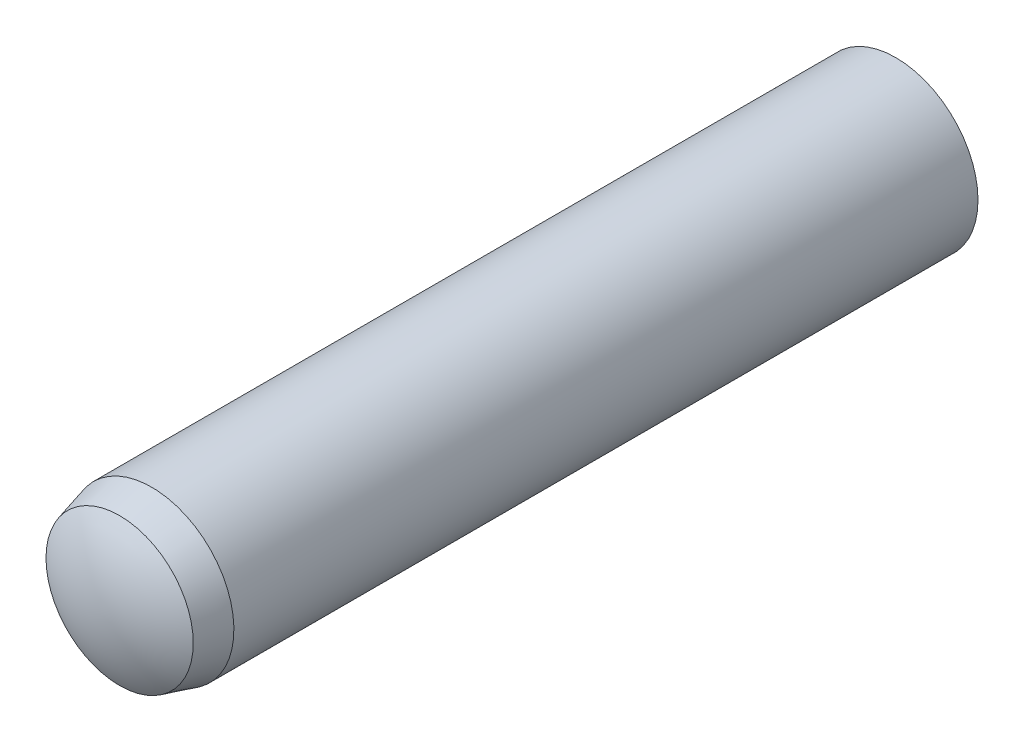
ISO-10303-21;
HEADER;
FILE_DESCRIPTION(('STEP AP214'),'2;1');
FILE_NAME('part.step','',(''),(''),'','','');
FILE_SCHEMA(('AUTOMOTIVE_DESIGN { 1 0 10303 214 1 1 1 1 }'));
ENDSEC;
DATA;
#1=APPLICATION_CONTEXT('core data for automotive mechanical design processes');
#2=APPLICATION_PROTOCOL_DEFINITION('international standard','automotive_design',2000,#1);
#3=PRODUCT_CONTEXT('',#1,'mechanical');
#4=PRODUCT('Part','Part','',(#3));
#5=PRODUCT_RELATED_PRODUCT_CATEGORY('part','',(#4));
#6=PRODUCT_DEFINITION_FORMATION('','',#4);
#7=PRODUCT_DEFINITION_CONTEXT('part definition',#1,'design');
#8=PRODUCT_DEFINITION('design','',#6,#7);
#9=PRODUCT_DEFINITION_SHAPE('','',#8);
#10=(LENGTH_UNIT() NAMED_UNIT(*) SI_UNIT(.MILLI.,.METRE.));
#11=(NAMED_UNIT(*) PLANE_ANGLE_UNIT() SI_UNIT($,.RADIAN.));
#12=(NAMED_UNIT(*) SI_UNIT($,.STERADIAN.) SOLID_ANGLE_UNIT());
#13=UNCERTAINTY_MEASURE_WITH_UNIT(LENGTH_MEASURE(1.E-05),#10,'distance_accuracy_value','');
#14=(GEOMETRIC_REPRESENTATION_CONTEXT(3) GLOBAL_UNCERTAINTY_ASSIGNED_CONTEXT((#13)) GLOBAL_UNIT_ASSIGNED_CONTEXT((#10,
#11,#12)) REPRESENTATION_CONTEXT('',''));
#15=CARTESIAN_POINT('',(0.,0.,0.));
#16=DIRECTION('',(0.,0.,1.));
#17=DIRECTION('',(1.,0.,0.));
#18=AXIS2_PLACEMENT_3D('',#15,#16,#17);
#19=CARTESIAN_POINT('',(0.,0.,-6.36666666666664));
#20=DIRECTION('',(0.,0.,1.));
#21=DIRECTION('',(0.,1.,0.));
#22=AXIS2_PLACEMENT_3D('',#19,#20,#21);
#23=SPHERICAL_SURFACE('',#22,3.63333333333335);
#24=CARTESIAN_POINT('',(0.,0.,-9.4));
#25=DIRECTION('',(0.,0.,1.));
#26=DIRECTION('',(0.,-1.,0.));
#27=AXIS2_PLACEMENT_3D('',#24,#25,#26);
#28=CIRCLE('',#27,2.);
#29=CARTESIAN_POINT('',(0.,-1.99999999999999,-9.4));
#30=VERTEX_POINT('',#29);
#31=EDGE_CURVE('E10',#30,#30,#28,.T.);
#32=ORIENTED_EDGE('',*,*,#31,.F.);
#33=EDGE_LOOP('',(#32));
#34=FACE_BOUND('',#33,.T.);
#35=ADVANCED_FACE('F39',(#34),#23,.T.);
#36=CARTESIAN_POINT('',(0.,0.,10.));
#37=DIRECTION('',(0.,0.,1.));
#38=DIRECTION('',(0.,-1.,0.));
#39=AXIS2_PLACEMENT_3D('',#36,#37,#38);
#40=CYLINDRICAL_SURFACE('',#39,2.);
#41=CARTESIAN_POINT('',(0.,0.,8.7));
#42=DIRECTION('',(0.,0.,1.));
#43=DIRECTION('',(0.,-1.,0.));
#44=AXIS2_PLACEMENT_3D('',#41,#42,#43);
#45=CIRCLE('',#44,2.);
#46=CARTESIAN_POINT('',(0.,-2.,8.7));
#47=VERTEX_POINT('',#46);
#48=EDGE_CURVE('E46',#47,#47,#45,.T.);
#49=ORIENTED_EDGE('',*,*,#48,.F.);
#50=EDGE_LOOP('',(#49));
#51=FACE_BOUND('',#50,.T.);
#52=ORIENTED_EDGE('',*,*,#31,.T.);
#53=EDGE_LOOP('',(#52));
#54=FACE_BOUND('',#53,.T.);
#55=ADVANCED_FACE('F66',(#51,#54),#40,.T.);
#56=CARTESIAN_POINT('',(0.,0.,8.7));
#57=DIRECTION('',(0.,0.,-1.));
#58=DIRECTION('',(0.,1.,0.));
#59=AXIS2_PLACEMENT_3D('',#56,#57,#58);
#60=CONICAL_SURFACE('',#59,2.,0.261799387799152);
#61=CARTESIAN_POINT('',(0.,0.,9.48));
#62=DIRECTION('',(0.,0.,1.));
#63=DIRECTION('',(0.,-1.,0.));
#64=AXIS2_PLACEMENT_3D('',#61,#62,#63);
#65=CIRCLE('',#64,1.79099962990372);
#66=CARTESIAN_POINT('',(0.,-1.79099962990372,9.48));
#67=VERTEX_POINT('',#66);
#68=EDGE_CURVE('E52',#67,#67,#65,.T.);
#69=ORIENTED_EDGE('',*,*,#68,.F.);
#70=EDGE_LOOP('',(#69));
#71=FACE_BOUND('',#70,.T.);
#72=ORIENTED_EDGE('',*,*,#48,.T.);
#73=EDGE_LOOP('',(#72));
#74=FACE_BOUND('',#73,.T.);
#75=ADVANCED_FACE('F64',(#71,#74),#60,.T.);
#76=CARTESIAN_POINT('',(0.,0.,6.6556926208507));
#77=DIRECTION('',(0.,0.,1.));
#78=DIRECTION('',(0.,1.,0.));
#79=AXIS2_PLACEMENT_3D('',#76,#77,#78);
#80=SPHERICAL_SURFACE('',#79,3.3443073791493);
#81=ORIENTED_EDGE('',*,*,#68,.T.);
#82=EDGE_LOOP('',(#81));
#83=FACE_BOUND('',#82,.T.);
#84=ADVANCED_FACE('F62',(#83),#80,.T.);
#85=CLOSED_SHELL('',(#35,#55,#75,#84));
#86=MANIFOLD_SOLID_BREP('B2',#85);
#87=ADVANCED_BREP_SHAPE_REPRESENTATION('',(#18,#86),#14);
#88=SHAPE_DEFINITION_REPRESENTATION(#9,#87);
ENDSEC;
END-ISO-10303-21;
